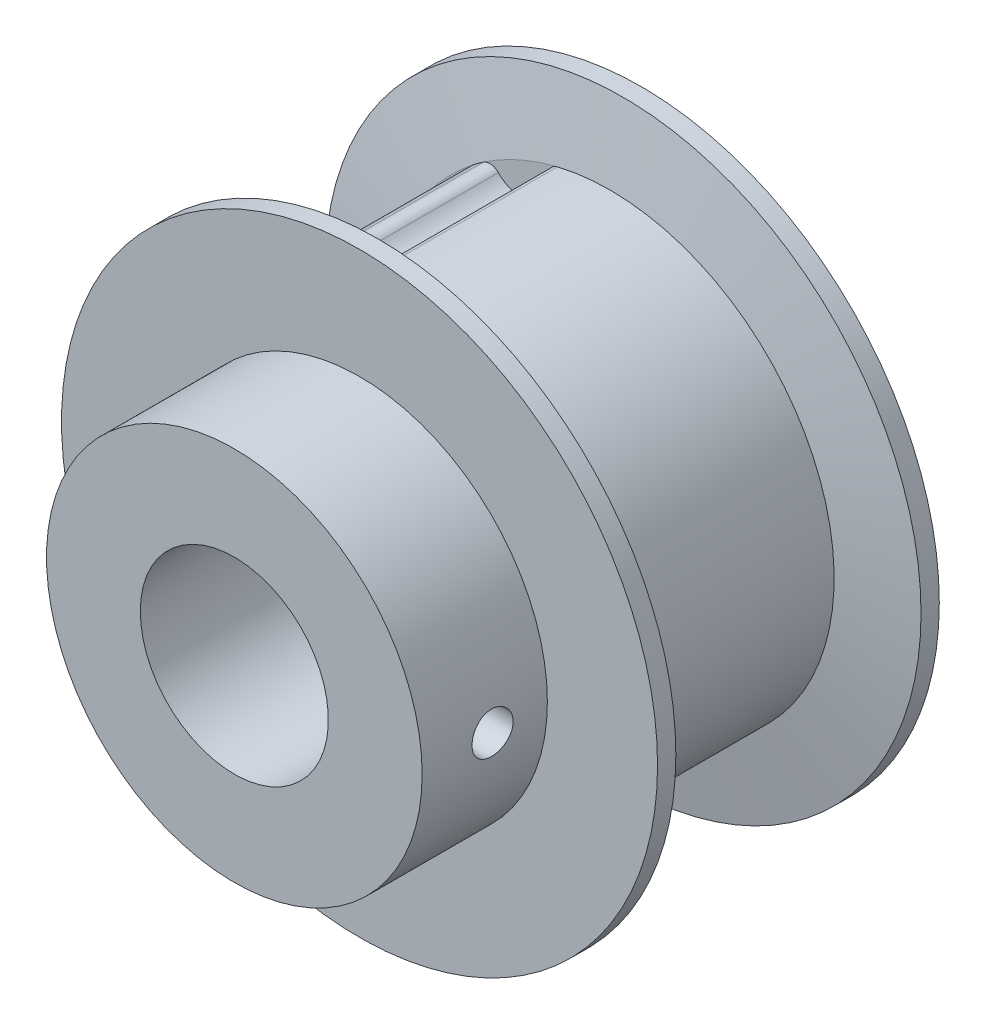
ISO-10303-21;
HEADER;
FILE_DESCRIPTION(('STEP AP214'),'2;1');
FILE_NAME('part.step','',(''),(''),'','','');
FILE_SCHEMA(('AUTOMOTIVE_DESIGN { 1 0 10303 214 1 1 1 1 }'));
ENDSEC;
DATA;
#1=APPLICATION_CONTEXT('core data for automotive mechanical design processes');
#2=APPLICATION_PROTOCOL_DEFINITION('international standard','automotive_design',2000,#1);
#3=PRODUCT_CONTEXT('',#1,'mechanical');
#4=PRODUCT('Part','Part','',(#3));
#5=PRODUCT_RELATED_PRODUCT_CATEGORY('part','',(#4));
#6=PRODUCT_DEFINITION_FORMATION('','',#4);
#7=PRODUCT_DEFINITION_CONTEXT('part definition',#1,'design');
#8=PRODUCT_DEFINITION('design','',#6,#7);
#9=PRODUCT_DEFINITION_SHAPE('','',#8);
#10=(LENGTH_UNIT() NAMED_UNIT(*) SI_UNIT(.MILLI.,.METRE.));
#11=(NAMED_UNIT(*) PLANE_ANGLE_UNIT() SI_UNIT($,.RADIAN.));
#12=(NAMED_UNIT(*) SI_UNIT($,.STERADIAN.) SOLID_ANGLE_UNIT());
#13=UNCERTAINTY_MEASURE_WITH_UNIT(LENGTH_MEASURE(1.E-05),#10,'distance_accuracy_value','');
#14=(GEOMETRIC_REPRESENTATION_CONTEXT(3) GLOBAL_UNCERTAINTY_ASSIGNED_CONTEXT((#13)) GLOBAL_UNIT_ASSIGNED_CONTEXT((#10,
#11,#12)) REPRESENTATION_CONTEXT('',''));
#15=CARTESIAN_POINT('',(0.,0.,0.));
#16=DIRECTION('',(0.,0.,1.));
#17=DIRECTION('',(1.,0.,0.));
#18=AXIS2_PLACEMENT_3D('',#15,#16,#17);
#19=CARTESIAN_POINT('',(0.,0.,-6.83854493654546));
#20=DIRECTION('',(0.,0.,1.));
#21=DIRECTION('',(1.,0.,0.));
#22=AXIS2_PLACEMENT_3D('',#19,#20,#21);
#23=CYLINDRICAL_SURFACE('',#22,11.3665);
#24=DIRECTION('',(0.,0.,1.));
#25=VECTOR('',#24,1.);
#26=CARTESIAN_POINT('',(-6.92571975920571,9.01286458718603,5.55625));
#27=LINE('',#26,#25);
#28=CARTESIAN_POINT('',(-6.92571975985629,9.0128645866861,5.55624999999923));
#29=VERTEX_POINT('',#28);
#30=CARTESIAN_POINT('',(-6.92571975985654,9.01286458668643,-5.55624999999925));
#31=VERTEX_POINT('',#30);
#32=EDGE_CURVE('E222',#29,#31,#27,.F.);
#33=ORIENTED_EDGE('',*,*,#32,.F.);
#34=CARTESIAN_POINT('',(0.,0.,5.55625));
#35=DIRECTION('',(0.,0.,1.));
#36=DIRECTION('',(1.,0.,0.));
#37=AXIS2_PLACEMENT_3D('',#34,#35,#36);
#38=CIRCLE('',#37,11.3665);
#39=CARTESIAN_POINT('',(-6.43157849157934,9.37187923293224,5.55625000000005));
#40=VERTEX_POINT('',#39);
#41=EDGE_CURVE('E240',#29,#40,#38,.F.);
#42=ORIENTED_EDGE('',*,*,#41,.T.);
#43=DIRECTION('',(0.,0.,1.));
#44=VECTOR('',#43,1.);
#45=CARTESIAN_POINT('',(-6.43157849225601,9.37187923246853,5.55625));
#46=LINE('',#45,#44);
#47=CARTESIAN_POINT('',(-6.43157849157945,9.3718792329324,-5.5562499999992));
#48=VERTEX_POINT('',#47);
#49=EDGE_CURVE('E219',#48,#40,#46,.T.);
#50=ORIENTED_EDGE('',*,*,#49,.F.);
#51=CARTESIAN_POINT('',(0.,0.,-5.55625));
#52=DIRECTION('',(0.,0.,1.));
#53=DIRECTION('',(1.,0.,0.));
#54=AXIS2_PLACEMENT_3D('',#51,#52,#53);
#55=CIRCLE('',#54,11.3665);
#56=EDGE_CURVE('E243',#48,#31,#55,.T.);
#57=ORIENTED_EDGE('',*,*,#56,.T.);
#58=EDGE_LOOP('',(#33,#42,#50,#57));
#59=FACE_BOUND('',#58,.T.);
#60=ADVANCED_FACE('F16',(#59),#23,.T.);
#61=CARTESIAN_POINT('',(0.,0.,-6.83854493654546));
#62=DIRECTION('',(0.,0.,1.));
#63=DIRECTION('',(1.,0.,0.));
#64=AXIS2_PLACEMENT_3D('',#61,#62,#63);
#65=CYLINDRICAL_SURFACE('',#64,11.3665);
#66=CARTESIAN_POINT('',(0.,0.,-5.55625));
#67=DIRECTION('',(0.,0.,1.));
#68=DIRECTION('',(1.,0.,0.));
#69=AXIS2_PLACEMENT_3D('',#66,#67,#68);
#70=CIRCLE('',#69,11.3665);
#71=CARTESIAN_POINT('',(-9.68742601496993,5.94567905747549,-5.55624999999925));
#72=VERTEX_POINT('',#71);
#73=CARTESIAN_POINT('',(-9.99282211400751,5.41671749750633,-5.55624999999916));
#74=VERTEX_POINT('',#73);
#75=EDGE_CURVE('E235',#72,#74,#70,.T.);
#76=ORIENTED_EDGE('',*,*,#75,.T.);
#77=DIRECTION('',(0.,0.,1.));
#78=VECTOR('',#77,1.);
#79=CARTESIAN_POINT('',(-9.99282211361638,5.41671749822686,5.55625));
#80=LINE('',#79,#78);
#81=CARTESIAN_POINT('',(-9.99282211400708,5.4167174975061,5.5562499999992));
#82=VERTEX_POINT('',#81);
#83=EDGE_CURVE('E211',#82,#74,#80,.F.);
#84=ORIENTED_EDGE('',*,*,#83,.F.);
#85=CARTESIAN_POINT('',(0.,0.,5.55625));
#86=DIRECTION('',(0.,0.,1.));
#87=DIRECTION('',(1.,0.,0.));
#88=AXIS2_PLACEMENT_3D('',#85,#86,#87);
#89=CIRCLE('',#88,11.3665);
#90=CARTESIAN_POINT('',(-9.68742601496977,5.94567905747539,5.55624999999923));
#91=VERTEX_POINT('',#90);
#92=EDGE_CURVE('E242',#82,#91,#89,.F.);
#93=ORIENTED_EDGE('',*,*,#92,.T.);
#94=DIRECTION('',(0.,0.,1.));
#95=VECTOR('',#94,1.);
#96=CARTESIAN_POINT('',(-9.68742601539869,5.94567905677654,5.55625));
#97=LINE('',#96,#95);
#98=EDGE_CURVE('E228',#72,#91,#97,.T.);
#99=ORIENTED_EDGE('',*,*,#98,.F.);
#100=EDGE_LOOP('',(#76,#84,#93,#99));
#101=FACE_BOUND('',#100,.T.);
#102=ADVANCED_FACE('F341',(#101),#65,.T.);
#103=CARTESIAN_POINT('',(-9.17653606159526,5.63211922404484,5.55625));
#104=DIRECTION('',(0.,0.,1.));
#105=DIRECTION('',(1.,0.,0.));
#106=AXIS2_PLACEMENT_3D('',#103,#104,#105);
#107=CYLINDRICAL_SURFACE('',#106,0.59944);
#108=CARTESIAN_POINT('',(-9.17653606159526,5.63211922404484,-5.55625));
#109=DIRECTION('',(0.,0.,1.));
#110=DIRECTION('',(1.,0.,0.));
#111=AXIS2_PLACEMENT_3D('',#108,#109,#110);
#112=CIRCLE('',#111,0.59944);
#113=CARTESIAN_POINT('',(-8.9552052355263,6.18920178438181,-5.55625));
#114=VERTEX_POINT('',#113);
#115=EDGE_CURVE('E19',#114,#72,#112,.T.);
#116=ORIENTED_EDGE('',*,*,#115,.T.);
#117=ORIENTED_EDGE('',*,*,#98,.T.);
#118=CARTESIAN_POINT('',(-9.17653606159526,5.63211922404484,5.55625));
#119=DIRECTION('',(0.,0.,1.));
#120=DIRECTION('',(1.,0.,0.));
#121=AXIS2_PLACEMENT_3D('',#118,#119,#120);
#122=CIRCLE('',#121,0.59944);
#123=CARTESIAN_POINT('',(-8.9552052355263,6.18920178438181,5.55625));
#124=VERTEX_POINT('',#123);
#125=EDGE_CURVE('E215',#91,#124,#122,.F.);
#126=ORIENTED_EDGE('',*,*,#125,.T.);
#127=DIRECTION('',(0.,0.,1.));
#128=VECTOR('',#127,1.);
#129=CARTESIAN_POINT('',(-8.95520523552598,6.18920178438165,5.55625));
#130=LINE('',#129,#128);
#131=EDGE_CURVE('E202',#124,#114,#130,.F.);
#132=ORIENTED_EDGE('',*,*,#131,.T.);
#133=EDGE_LOOP('',(#116,#117,#126,#132));
#134=FACE_BOUND('',#133,.T.);
#135=ADVANCED_FACE('F332',(#134),#107,.T.);
#136=CARTESIAN_POINT('',(-6.5604750982768,8.53754926946218,5.55625));
#137=DIRECTION('',(0.,0.,1.));
#138=DIRECTION('',(1.,0.,0.));
#139=AXIS2_PLACEMENT_3D('',#136,#137,#138);
#140=CYLINDRICAL_SURFACE('',#139,0.59944);
#141=DIRECTION('',(0.,0.,1.));
#142=VECTOR('',#141,1.);
#143=CARTESIAN_POINT('',(-7.09137053093834,8.25919993287166,5.55625));
#144=LINE('',#143,#142);
#145=CARTESIAN_POINT('',(-7.09137053093783,8.25919993287182,-5.55625));
#146=VERTEX_POINT('',#145);
#147=CARTESIAN_POINT('',(-7.09137053093783,8.25919993287182,5.55625));
#148=VERTEX_POINT('',#147);
#149=EDGE_CURVE('E197',#146,#148,#144,.T.);
#150=ORIENTED_EDGE('',*,*,#149,.T.);
#151=CARTESIAN_POINT('',(-6.5604750982768,8.53754926946218,5.55625));
#152=DIRECTION('',(0.,0.,1.));
#153=DIRECTION('',(1.,0.,0.));
#154=AXIS2_PLACEMENT_3D('',#151,#152,#153);
#155=CIRCLE('',#154,0.59944);
#156=EDGE_CURVE('E212',#148,#29,#155,.F.);
#157=ORIENTED_EDGE('',*,*,#156,.T.);
#158=ORIENTED_EDGE('',*,*,#32,.T.);
#159=CARTESIAN_POINT('',(-6.5604750982768,8.53754926946218,-5.55625));
#160=DIRECTION('',(0.,0.,1.));
#161=DIRECTION('',(1.,0.,0.));
#162=AXIS2_PLACEMENT_3D('',#159,#160,#161);
#163=CIRCLE('',#162,0.59944);
#164=EDGE_CURVE('E221',#31,#146,#163,.T.);
#165=ORIENTED_EDGE('',*,*,#164,.T.);
#166=EDGE_LOOP('',(#150,#157,#158,#165));
#167=FACE_BOUND('',#166,.T.);
#168=ADVANCED_FACE('F347',(#167),#140,.T.);
#169=CARTESIAN_POINT('',(-6.09239356937188,8.87763040678648,5.55625));
#170=DIRECTION('',(0.,0.,1.));
#171=DIRECTION('',(1.,0.,0.));
#172=AXIS2_PLACEMENT_3D('',#169,#170,#171);
#173=CYLINDRICAL_SURFACE('',#172,0.59944);
#174=CARTESIAN_POINT('',(-6.09239356937188,8.87763040678648,-5.55625));
#175=DIRECTION('',(0.,0.,1.));
#176=DIRECTION('',(1.,0.,0.));
#177=AXIS2_PLACEMENT_3D('',#174,#175,#176);
#178=CIRCLE('',#177,0.59944);
#179=CARTESIAN_POINT('',(-5.66361190807295,9.29652729210982,-5.55625));
#180=VERTEX_POINT('',#179);
#181=EDGE_CURVE('E220',#180,#48,#178,.T.);
#182=ORIENTED_EDGE('',*,*,#181,.T.);
#183=ORIENTED_EDGE('',*,*,#49,.T.);
#184=CARTESIAN_POINT('',(-6.09239356937188,8.87763040678648,5.55625));
#185=DIRECTION('',(0.,0.,1.));
#186=DIRECTION('',(1.,0.,0.));
#187=AXIS2_PLACEMENT_3D('',#184,#185,#186);
#188=CIRCLE('',#187,0.59944);
#189=CARTESIAN_POINT('',(-5.66361190807295,9.29652729210982,5.55625));
#190=VERTEX_POINT('',#189);
#191=EDGE_CURVE('E217',#40,#190,#188,.F.);
#192=ORIENTED_EDGE('',*,*,#191,.T.);
#193=DIRECTION('',(0.,0.,1.));
#194=VECTOR('',#193,1.);
#195=CARTESIAN_POINT('',(-5.66361190807289,9.29652729210959,5.55625));
#196=LINE('',#195,#194);
#197=EDGE_CURVE('E193',#190,#180,#196,.F.);
#198=ORIENTED_EDGE('',*,*,#197,.T.);
#199=EDGE_LOOP('',(#182,#183,#192,#198));
#200=FACE_BOUND('',#199,.T.);
#201=ADVANCED_FACE('F353',(#200),#173,.T.);
#202=CARTESIAN_POINT('',(0.,0.,5.55625));
#203=DIRECTION('',(0.,0.,1.));
#204=DIRECTION('',(1.,0.,0.));
#205=AXIS2_PLACEMENT_3D('',#202,#203,#204);
#206=PLANE('',#205);
#207=CARTESIAN_POINT('',(-4.81474897364002,10.3207619131949,5.55625));
#208=DIRECTION('',(0.,0.,1.));
#209=DIRECTION('',(1.,0.,0.));
#210=AXIS2_PLACEMENT_3D('',#207,#208,#209);
#211=CIRCLE('',#210,1.69926);
#212=CARTESIAN_POINT('',(-3.11897008181064,10.4294748269975,5.55625));
#213=VERTEX_POINT('',#212);
#214=CARTESIAN_POINT('',(-3.94512141991133,8.86088778663605,5.55625));
#215=VERTEX_POINT('',#214);
#216=EDGE_CURVE('E189',#213,#215,#211,.F.);
#217=ORIENTED_EDGE('',*,*,#216,.T.);
#218=CARTESIAN_POINT('',(-4.4481249105777,10.4839934627941,5.55625));
#219=DIRECTION('',(0.,0.,1.));
#220=DIRECTION('',(1.,0.,0.));
#221=AXIS2_PLACEMENT_3D('',#218,#219,#220);
#222=CIRCLE('',#221,1.69926);
#223=EDGE_CURVE('E194',#215,#190,#222,.F.);
#224=ORIENTED_EDGE('',*,*,#223,.T.);
#225=ORIENTED_EDGE('',*,*,#191,.F.);
#226=CARTESIAN_POINT('',(0.,0.,5.55624999999832));
#227=DIRECTION('',(0.,0.,1.));
#228=DIRECTION('',(1.,0.,0.));
#229=AXIS2_PLACEMENT_3D('',#226,#227,#228);
#230=CIRCLE('',#229,11.3665000000005);
#231=CARTESIAN_POINT('',(-2.66109754103617,11.0506055095227,5.55624999999921));
#232=VERTEX_POINT('',#231);
#233=EDGE_CURVE('E181',#232,#40,#230,.T.);
#234=ORIENTED_EDGE('',*,*,#233,.F.);
#235=CARTESIAN_POINT('',(-2.52075809605285,10.4678249729721,5.55625));
#236=DIRECTION('',(0.,0.,1.));
#237=DIRECTION('',(1.,0.,0.));
#238=AXIS2_PLACEMENT_3D('',#235,#236,#237);
#239=CIRCLE('',#238,0.59944);
#240=EDGE_CURVE('E185',#213,#232,#239,.F.);
#241=ORIENTED_EDGE('',*,*,#240,.F.);
#242=EDGE_LOOP('',(#217,#224,#225,#234,#241));
#243=FACE_BOUND('',#242,.T.);
#244=ADVANCED_FACE('F356',(#243),#206,.F.);
#245=CARTESIAN_POINT('',(0.,0.,5.55625));
#246=DIRECTION('',(0.,0.,1.));
#247=DIRECTION('',(1.,0.,0.));
#248=AXIS2_PLACEMENT_3D('',#245,#246,#247);
#249=PLANE('',#248);
#250=CARTESIAN_POINT('',(-8.59632410911572,7.47015033041876,5.55625));
#251=DIRECTION('',(0.,0.,1.));
#252=DIRECTION('',(1.,0.,0.));
#253=AXIS2_PLACEMENT_3D('',#250,#251,#252);
#254=CIRCLE('',#253,1.69926);
#255=CARTESIAN_POINT('',(-7.20809550601794,6.49019834529848,5.55625));
#256=VERTEX_POINT('',#255);
#257=EDGE_CURVE('E198',#148,#256,#254,.F.);
#258=ORIENTED_EDGE('',*,*,#257,.T.);
#259=CARTESIAN_POINT('',(-8.32778861417102,7.76838921177826,5.55625));
#260=DIRECTION('',(0.,0.,1.));
#261=DIRECTION('',(1.,0.,0.));
#262=AXIS2_PLACEMENT_3D('',#259,#260,#261);
#263=CIRCLE('',#262,1.69926);
#264=EDGE_CURVE('E203',#256,#124,#263,.F.);
#265=ORIENTED_EDGE('',*,*,#264,.T.);
#266=ORIENTED_EDGE('',*,*,#125,.F.);
#267=CARTESIAN_POINT('',(0.,0.,5.55624999999837));
#268=DIRECTION('',(0.,0.,1.));
#269=DIRECTION('',(1.,0.,0.));
#270=AXIS2_PLACEMENT_3D('',#267,#268,#269);
#271=CIRCLE('',#270,11.3665000000008);
#272=EDGE_CURVE('E178',#29,#91,#271,.T.);
#273=ORIENTED_EDGE('',*,*,#272,.F.);
#274=ORIENTED_EDGE('',*,*,#156,.F.);
#275=EDGE_LOOP('',(#258,#265,#266,#273,#274));
#276=FACE_BOUND('',#275,.T.);
#277=ADVANCED_FACE('F360',(#276),#249,.F.);
#278=CARTESIAN_POINT('',(0.,0.,5.55625));
#279=DIRECTION('',(0.,0.,1.));
#280=DIRECTION('',(1.,0.,0.));
#281=AXIS2_PLACEMENT_3D('',#278,#279,#280);
#282=PLANE('',#281);
#283=CARTESIAN_POINT('',(-10.8915167109718,3.32788189132984,5.55625));
#284=DIRECTION('',(0.,0.,1.));
#285=DIRECTION('',(1.,0.,0.));
#286=AXIS2_PLACEMENT_3D('',#283,#284,#285);
#287=CIRCLE('',#286,1.69926);
#288=CARTESIAN_POINT('',(-9.83760859218593,4.66083433787746,5.55625));
#289=VERTEX_POINT('',#288);
#290=CARTESIAN_POINT('',(-9.22472439563864,2.99729464846287,5.55625));
#291=VERTEX_POINT('',#290);
#292=EDGE_CURVE('E141',#289,#291,#287,.F.);
#293=ORIENTED_EDGE('',*,*,#292,.T.);
#294=CARTESIAN_POINT('',(-10.7675020107898,3.7095598924478,5.55625));
#295=DIRECTION('',(0.,0.,1.));
#296=DIRECTION('',(1.,0.,0.));
#297=AXIS2_PLACEMENT_3D('',#294,#295,#296);
#298=CIRCLE('',#297,1.69926);
#299=CARTESIAN_POINT('',(-10.6983622222705,2.01170706100379,5.55625));
#300=VERTEX_POINT('',#299);
#301=EDGE_CURVE('E119',#291,#300,#298,.F.);
#302=ORIENTED_EDGE('',*,*,#301,.T.);
#303=CARTESIAN_POINT('',(-10.6739721025541,1.41276346127185,5.55625));
#304=DIRECTION('',(0.,0.,1.));
#305=DIRECTION('',(1.,0.,0.));
#306=AXIS2_PLACEMENT_3D('',#303,#304,#305);
#307=CIRCLE('',#306,0.59944);
#308=CARTESIAN_POINT('',(-11.2682295728675,1.49141695818421,5.5562499999992));
#309=VERTEX_POINT('',#308);
#310=EDGE_CURVE('E136',#309,#300,#307,.F.);
#311=ORIENTED_EDGE('',*,*,#310,.F.);
#312=CARTESIAN_POINT('',(0.,0.,5.5562499999983));
#313=DIRECTION('',(0.,0.,1.));
#314=DIRECTION('',(1.,0.,0.));
#315=AXIS2_PLACEMENT_3D('',#312,#313,#314);
#316=CIRCLE('',#315,11.3665000000004);
#317=EDGE_CURVE('E176',#82,#309,#316,.T.);
#318=ORIENTED_EDGE('',*,*,#317,.F.);
#319=CARTESIAN_POINT('',(-9.46582635596246,5.13105373606098,5.55625));
#320=DIRECTION('',(0.,0.,1.));
#321=DIRECTION('',(1.,0.,0.));
#322=AXIS2_PLACEMENT_3D('',#319,#320,#321);
#323=CIRCLE('',#322,0.59944);
#324=EDGE_CURVE('E206',#289,#82,#323,.F.);
#325=ORIENTED_EDGE('',*,*,#324,.F.);
#326=EDGE_LOOP('',(#293,#302,#311,#318,#325));
#327=FACE_BOUND('',#326,.T.);
#328=ADVANCED_FACE('F364',(#327),#282,.F.);
#329=CARTESIAN_POINT('',(-9.46582635596246,5.13105373606098,5.55625));
#330=DIRECTION('',(0.,0.,1.));
#331=DIRECTION('',(1.,0.,0.));
#332=AXIS2_PLACEMENT_3D('',#329,#330,#331);
#333=CYLINDRICAL_SURFACE('',#332,0.59944);
#334=DIRECTION('',(0.,0.,1.));
#335=VECTOR('',#334,1.);
#336=CARTESIAN_POINT('',(-9.83760859218621,4.66083433787767,5.55625));
#337=LINE('',#336,#335);
#338=CARTESIAN_POINT('',(-9.83760859218609,4.66083433787726,-5.55625));
#339=VERTEX_POINT('',#338);
#340=EDGE_CURVE('E171',#339,#289,#337,.T.);
#341=ORIENTED_EDGE('',*,*,#340,.T.);
#342=ORIENTED_EDGE('',*,*,#324,.T.);
#343=ORIENTED_EDGE('',*,*,#83,.T.);
#344=CARTESIAN_POINT('',(-9.46582635596246,5.13105373606098,-5.55625));
#345=DIRECTION('',(0.,0.,1.));
#346=DIRECTION('',(1.,0.,0.));
#347=AXIS2_PLACEMENT_3D('',#344,#345,#346);
#348=CIRCLE('',#347,0.59944);
#349=EDGE_CURVE('E209',#74,#339,#348,.T.);
#350=ORIENTED_EDGE('',*,*,#349,.T.);
#351=EDGE_LOOP('',(#341,#342,#343,#350));
#352=FACE_BOUND('',#351,.T.);
#353=ADVANCED_FACE('F368',(#352),#333,.T.);
#354=CARTESIAN_POINT('',(0.,0.,-7.14375));
#355=DIRECTION('',(0.,0.,1.));
#356=DIRECTION('',(1.,0.,0.));
#357=AXIS2_PLACEMENT_3D('',#354,#355,#356);
#358=CYLINDRICAL_SURFACE('',#357,15.113);
#359=CARTESIAN_POINT('',(0.,0.,7.14375));
#360=DIRECTION('',(0.,0.,1.));
#361=DIRECTION('',(1.,0.,0.));
#362=AXIS2_PLACEMENT_3D('',#359,#360,#361);
#363=CIRCLE('',#362,15.113);
#364=CARTESIAN_POINT('',(15.113,0.,7.14375));
#365=VERTEX_POINT('',#364);
#366=EDGE_CURVE('E168',#365,#365,#363,.T.);
#367=ORIENTED_EDGE('',*,*,#366,.F.);
#368=EDGE_LOOP('',(#367));
#369=FACE_BOUND('',#368,.T.);
#370=CARTESIAN_POINT('',(0.,0.,6.21685903322354));
#371=DIRECTION('',(0.,0.,1.));
#372=DIRECTION('',(0.,1.,0.));
#373=AXIS2_PLACEMENT_3D('',#370,#371,#372);
#374=CIRCLE('',#373,15.1130000000001);
#375=CARTESIAN_POINT('',(0.,15.1130000000001,6.21685903322354));
#376=VERTEX_POINT('',#375);
#377=EDGE_CURVE('E184',#376,#376,#374,.F.);
#378=ORIENTED_EDGE('',*,*,#377,.F.);
#379=EDGE_LOOP('',(#378));
#380=FACE_BOUND('',#379,.T.);
#381=ADVANCED_FACE('F372',(#369,#380),#358,.T.);
#382=CARTESIAN_POINT('',(-8.32778861417102,7.76838921177826,5.55625));
#383=DIRECTION('',(0.,0.,1.));
#384=DIRECTION('',(1.,0.,0.));
#385=AXIS2_PLACEMENT_3D('',#382,#383,#384);
#386=CYLINDRICAL_SURFACE('',#385,1.69926);
#387=CARTESIAN_POINT('',(-8.32778861417102,7.76838921177826,-5.55625));
#388=DIRECTION('',(0.,0.,1.));
#389=DIRECTION('',(1.,0.,0.));
#390=AXIS2_PLACEMENT_3D('',#387,#388,#389);
#391=CIRCLE('',#390,1.69926);
#392=CARTESIAN_POINT('',(-7.20809550601794,6.49019834529848,-5.55625));
#393=VERTEX_POINT('',#392);
#394=EDGE_CURVE('E166',#114,#393,#391,.T.);
#395=ORIENTED_EDGE('',*,*,#394,.F.);
#396=ORIENTED_EDGE('',*,*,#131,.F.);
#397=ORIENTED_EDGE('',*,*,#264,.F.);
#398=DIRECTION('',(0.,0.,1.));
#399=VECTOR('',#398,1.);
#400=CARTESIAN_POINT('',(-7.20809550601637,6.49019834530069,5.55625));
#401=LINE('',#400,#399);
#402=EDGE_CURVE('E201',#256,#393,#401,.F.);
#403=ORIENTED_EDGE('',*,*,#402,.T.);
#404=EDGE_LOOP('',(#395,#396,#397,#403));
#405=FACE_BOUND('',#404,.T.);
#406=ADVANCED_FACE('F376',(#405),#386,.F.);
#407=CARTESIAN_POINT('',(-8.59632410911572,7.47015033041876,5.55625));
#408=DIRECTION('',(0.,0.,1.));
#409=DIRECTION('',(1.,0.,0.));
#410=AXIS2_PLACEMENT_3D('',#407,#408,#409);
#411=CYLINDRICAL_SURFACE('',#410,1.69926);
#412=CARTESIAN_POINT('',(-8.59632410911572,7.47015033041876,-5.55625));
#413=DIRECTION('',(0.,0.,1.));
#414=DIRECTION('',(1.,0.,0.));
#415=AXIS2_PLACEMENT_3D('',#412,#413,#414);
#416=CIRCLE('',#415,1.69926);
#417=EDGE_CURVE('E163',#393,#146,#416,.T.);
#418=ORIENTED_EDGE('',*,*,#417,.F.);
#419=ORIENTED_EDGE('',*,*,#402,.F.);
#420=ORIENTED_EDGE('',*,*,#257,.F.);
#421=ORIENTED_EDGE('',*,*,#149,.F.);
#422=EDGE_LOOP('',(#418,#419,#420,#421));
#423=FACE_BOUND('',#422,.T.);
#424=ADVANCED_FACE('F380',(#423),#411,.F.);
#425=CARTESIAN_POINT('',(-4.4481249105777,10.4839934627941,5.55625));
#426=DIRECTION('',(0.,0.,1.));
#427=DIRECTION('',(1.,0.,0.));
#428=AXIS2_PLACEMENT_3D('',#425,#426,#427);
#429=CYLINDRICAL_SURFACE('',#428,1.69926);
#430=CARTESIAN_POINT('',(-4.4481249105777,10.4839934627941,-5.55625));
#431=DIRECTION('',(0.,0.,1.));
#432=DIRECTION('',(1.,0.,0.));
#433=AXIS2_PLACEMENT_3D('',#430,#431,#432);
#434=CIRCLE('',#433,1.69926);
#435=CARTESIAN_POINT('',(-3.94512141991133,8.86088778663605,-5.55625));
#436=VERTEX_POINT('',#435);
#437=EDGE_CURVE('E161',#180,#436,#434,.T.);
#438=ORIENTED_EDGE('',*,*,#437,.F.);
#439=ORIENTED_EDGE('',*,*,#197,.F.);
#440=ORIENTED_EDGE('',*,*,#223,.F.);
#441=DIRECTION('',(0.,0.,1.));
#442=VECTOR('',#441,1.);
#443=CARTESIAN_POINT('',(-3.94512141991031,8.86088778663666,5.55625));
#444=LINE('',#443,#442);
#445=EDGE_CURVE('E192',#215,#436,#444,.F.);
#446=ORIENTED_EDGE('',*,*,#445,.T.);
#447=EDGE_LOOP('',(#438,#439,#440,#446));
#448=FACE_BOUND('',#447,.T.);
#449=ADVANCED_FACE('F384',(#448),#429,.F.);
#450=CARTESIAN_POINT('',(-4.81474897364002,10.3207619131949,5.55625));
#451=DIRECTION('',(0.,0.,1.));
#452=DIRECTION('',(1.,0.,0.));
#453=AXIS2_PLACEMENT_3D('',#450,#451,#452);
#454=CYLINDRICAL_SURFACE('',#453,1.69926);
#455=CARTESIAN_POINT('',(-4.81474897364002,10.3207619131949,-5.55625));
#456=DIRECTION('',(0.,0.,1.));
#457=DIRECTION('',(1.,0.,0.));
#458=AXIS2_PLACEMENT_3D('',#455,#456,#457);
#459=CIRCLE('',#458,1.69926);
#460=CARTESIAN_POINT('',(-3.11897008181064,10.4294748269975,-5.55625));
#461=VERTEX_POINT('',#460);
#462=EDGE_CURVE('E159',#436,#461,#459,.T.);
#463=ORIENTED_EDGE('',*,*,#462,.F.);
#464=ORIENTED_EDGE('',*,*,#445,.F.);
#465=ORIENTED_EDGE('',*,*,#216,.F.);
#466=DIRECTION('',(0.,0.,1.));
#467=VECTOR('',#466,1.);
#468=CARTESIAN_POINT('',(-3.11897008181021,10.429474826998,5.55625));
#469=LINE('',#468,#467);
#470=EDGE_CURVE('E188',#461,#213,#469,.T.);
#471=ORIENTED_EDGE('',*,*,#470,.F.);
#472=EDGE_LOOP('',(#463,#464,#465,#471));
#473=FACE_BOUND('',#472,.T.);
#474=ADVANCED_FACE('F388',(#473),#454,.F.);
#475=CARTESIAN_POINT('',(-2.52075809605285,10.4678249729721,5.55625));
#476=DIRECTION('',(0.,0.,1.));
#477=DIRECTION('',(1.,0.,0.));
#478=AXIS2_PLACEMENT_3D('',#475,#476,#477);
#479=CYLINDRICAL_SURFACE('',#478,0.59944);
#480=ORIENTED_EDGE('',*,*,#240,.T.);
#481=DIRECTION('',(0.,0.,1.));
#482=VECTOR('',#481,1.);
#483=CARTESIAN_POINT('',(-2.66109754023772,11.0506055097149,-6.83854493654546));
#484=LINE('',#483,#482);
#485=CARTESIAN_POINT('',(-2.66109754103616,11.0506055095227,-5.5562499999992));
#486=VERTEX_POINT('',#485);
#487=EDGE_CURVE('E158',#486,#232,#484,.T.);
#488=ORIENTED_EDGE('',*,*,#487,.F.);
#489=CARTESIAN_POINT('',(-2.52075809605285,10.4678249729721,-5.55625));
#490=DIRECTION('',(0.,0.,1.));
#491=DIRECTION('',(1.,0.,0.));
#492=AXIS2_PLACEMENT_3D('',#489,#490,#491);
#493=CIRCLE('',#492,0.59944);
#494=EDGE_CURVE('E155',#461,#486,#493,.F.);
#495=ORIENTED_EDGE('',*,*,#494,.F.);
#496=ORIENTED_EDGE('',*,*,#470,.T.);
#497=EDGE_LOOP('',(#480,#488,#495,#496));
#498=FACE_BOUND('',#497,.T.);
#499=ADVANCED_FACE('F392',(#498),#479,.T.);
#500=CARTESIAN_POINT('',(0.,0.,6.21685903322354));
#501=DIRECTION('',(0.,0.,1.));
#502=DIRECTION('',(1.,0.,0.));
#503=AXIS2_PLACEMENT_3D('',#500,#501,#502);
#504=CONICAL_SURFACE('',#503,15.1130000000001,1.3962634015952);
#505=ORIENTED_EDGE('',*,*,#377,.T.);
#506=EDGE_LOOP('',(#505));
#507=FACE_BOUND('',#506,.T.);
#508=ORIENTED_EDGE('',*,*,#92,.F.);
#509=ORIENTED_EDGE('',*,*,#317,.T.);
#510=CARTESIAN_POINT('',(0.,0.,5.55625));
#511=DIRECTION('',(0.,0.,1.));
#512=DIRECTION('',(1.,0.,0.));
#513=AXIS2_PLACEMENT_3D('',#510,#511,#512);
#514=CIRCLE('',#513,11.3665);
#515=EDGE_CURVE('E151',#232,#309,#514,.F.);
#516=ORIENTED_EDGE('',*,*,#515,.F.);
#517=ORIENTED_EDGE('',*,*,#233,.T.);
#518=ORIENTED_EDGE('',*,*,#41,.F.);
#519=ORIENTED_EDGE('',*,*,#272,.T.);
#520=EDGE_LOOP('',(#508,#509,#516,#517,#518,#519));
#521=FACE_BOUND('',#520,.T.);
#522=ADVANCED_FACE('F396',(#507,#521),#504,.T.);
#523=CARTESIAN_POINT('',(-10.6739721025541,1.41276346127185,5.55625));
#524=DIRECTION('',(0.,0.,1.));
#525=DIRECTION('',(1.,0.,0.));
#526=AXIS2_PLACEMENT_3D('',#523,#524,#525);
#527=CYLINDRICAL_SURFACE('',#526,0.59944);
#528=CARTESIAN_POINT('',(-10.6739721025541,1.41276346127185,-5.55625));
#529=DIRECTION('',(0.,0.,1.));
#530=DIRECTION('',(1.,0.,0.));
#531=AXIS2_PLACEMENT_3D('',#528,#529,#530);
#532=CIRCLE('',#531,0.59944);
#533=CARTESIAN_POINT('',(-10.6983622222705,2.01170706100379,-5.55625));
#534=VERTEX_POINT('',#533);
#535=CARTESIAN_POINT('',(-11.2682295728676,1.49141695818423,-5.55624999999919));
#536=VERTEX_POINT('',#535);
#537=EDGE_CURVE('E34',#534,#536,#532,.T.);
#538=ORIENTED_EDGE('',*,*,#537,.T.);
#539=DIRECTION('',(0.,0.,1.));
#540=VECTOR('',#539,1.);
#541=CARTESIAN_POINT('',(-11.2682295729749,1.49141695737067,-6.83854493654546));
#542=LINE('',#541,#540);
#543=EDGE_CURVE('E147',#309,#536,#542,.F.);
#544=ORIENTED_EDGE('',*,*,#543,.F.);
#545=ORIENTED_EDGE('',*,*,#310,.T.);
#546=DIRECTION('',(0.,0.,1.));
#547=VECTOR('',#546,1.);
#548=CARTESIAN_POINT('',(-10.6983622222701,2.0117070610035,5.55625));
#549=LINE('',#548,#547);
#550=EDGE_CURVE('E138',#300,#534,#549,.F.);
#551=ORIENTED_EDGE('',*,*,#550,.T.);
#552=EDGE_LOOP('',(#538,#544,#545,#551));
#553=FACE_BOUND('',#552,.T.);
#554=ADVANCED_FACE('F139',(#553),#527,.T.);
#555=CARTESIAN_POINT('',(-10.7675020107898,3.7095598924478,5.55625));
#556=DIRECTION('',(0.,0.,1.));
#557=DIRECTION('',(1.,0.,0.));
#558=AXIS2_PLACEMENT_3D('',#555,#556,#557);
#559=CYLINDRICAL_SURFACE('',#558,1.69926);
#560=CARTESIAN_POINT('',(-10.7675020107898,3.7095598924478,-5.55625));
#561=DIRECTION('',(0.,0.,1.));
#562=DIRECTION('',(1.,0.,0.));
#563=AXIS2_PLACEMENT_3D('',#560,#561,#562);
#564=CIRCLE('',#563,1.69926);
#565=CARTESIAN_POINT('',(-9.22472439563864,2.99729464846287,-5.55625));
#566=VERTEX_POINT('',#565);
#567=EDGE_CURVE('E130',#534,#566,#564,.T.);
#568=ORIENTED_EDGE('',*,*,#567,.F.);
#569=ORIENTED_EDGE('',*,*,#550,.F.);
#570=ORIENTED_EDGE('',*,*,#301,.F.);
#571=DIRECTION('',(0.,0.,1.));
#572=VECTOR('',#571,1.);
#573=CARTESIAN_POINT('',(-9.22472439563877,2.99729464846221,5.55625));
#574=LINE('',#573,#572);
#575=EDGE_CURVE('E144',#291,#566,#574,.F.);
#576=ORIENTED_EDGE('',*,*,#575,.T.);
#577=EDGE_LOOP('',(#568,#569,#570,#576));
#578=FACE_BOUND('',#577,.T.);
#579=ADVANCED_FACE('F143',(#578),#559,.F.);
#580=CARTESIAN_POINT('',(-10.8915167109718,3.32788189132984,5.55625));
#581=DIRECTION('',(0.,0.,1.));
#582=DIRECTION('',(1.,0.,0.));
#583=AXIS2_PLACEMENT_3D('',#580,#581,#582);
#584=CYLINDRICAL_SURFACE('',#583,1.69926);
#585=CARTESIAN_POINT('',(-10.8915167109718,3.32788189132984,-5.55625));
#586=DIRECTION('',(0.,0.,1.));
#587=DIRECTION('',(1.,0.,0.));
#588=AXIS2_PLACEMENT_3D('',#585,#586,#587);
#589=CIRCLE('',#588,1.69926);
#590=EDGE_CURVE('E146',#566,#339,#589,.T.);
#591=ORIENTED_EDGE('',*,*,#590,.F.);
#592=ORIENTED_EDGE('',*,*,#575,.F.);
#593=ORIENTED_EDGE('',*,*,#292,.F.);
#594=ORIENTED_EDGE('',*,*,#340,.F.);
#595=EDGE_LOOP('',(#591,#592,#593,#594));
#596=FACE_BOUND('',#595,.T.);
#597=ADVANCED_FACE('F405',(#596),#584,.F.);
#598=CARTESIAN_POINT('',(0.,0.,7.14375));
#599=DIRECTION('',(0.,0.,1.));
#600=DIRECTION('',(1.,0.,0.));
#601=AXIS2_PLACEMENT_3D('',#598,#599,#600);
#602=PLANE('',#601);
#603=CARTESIAN_POINT('',(0.,0.,7.14375));
#604=DIRECTION('',(0.,0.,1.));
#605=DIRECTION('',(1.,0.,0.));
#606=AXIS2_PLACEMENT_3D('',#603,#604,#605);
#607=CIRCLE('',#606,9.525);
#608=CARTESIAN_POINT('',(9.525,0.,7.14375));
#609=VERTEX_POINT('',#608);
#610=EDGE_CURVE('E149',#609,#609,#607,.T.);
#611=ORIENTED_EDGE('',*,*,#610,.F.);
#612=EDGE_LOOP('',(#611));
#613=FACE_BOUND('',#612,.T.);
#614=ORIENTED_EDGE('',*,*,#366,.T.);
#615=EDGE_LOOP('',(#614));
#616=FACE_BOUND('',#615,.T.);
#617=ADVANCED_FACE('F408',(#613,#616),#602,.T.);
#618=CARTESIAN_POINT('',(0.,0.,-5.55625));
#619=DIRECTION('',(0.,0.,1.));
#620=DIRECTION('',(1.,0.,0.));
#621=AXIS2_PLACEMENT_3D('',#618,#619,#620);
#622=PLANE('',#621);
#623=ORIENTED_EDGE('',*,*,#164,.F.);
#624=CARTESIAN_POINT('',(0.,0.,-5.55624999999842));
#625=DIRECTION('',(0.,0.,-1.));
#626=DIRECTION('',(-1.,0.,0.));
#627=AXIS2_PLACEMENT_3D('',#624,#625,#626);
#628=CIRCLE('',#627,11.366500000001);
#629=EDGE_CURVE('E336',#72,#31,#628,.T.);
#630=ORIENTED_EDGE('',*,*,#629,.F.);
#631=ORIENTED_EDGE('',*,*,#115,.F.);
#632=ORIENTED_EDGE('',*,*,#394,.T.);
#633=ORIENTED_EDGE('',*,*,#417,.T.);
#634=EDGE_LOOP('',(#623,#630,#631,#632,#633));
#635=FACE_BOUND('',#634,.T.);
#636=ADVANCED_FACE('F337',(#635),#622,.T.);
#637=CARTESIAN_POINT('',(0.,0.,-5.55625));
#638=DIRECTION('',(0.,0.,1.));
#639=DIRECTION('',(1.,0.,0.));
#640=AXIS2_PLACEMENT_3D('',#637,#638,#639);
#641=PLANE('',#640);
#642=ORIENTED_EDGE('',*,*,#494,.T.);
#643=CARTESIAN_POINT('',(0.,0.,-5.55624999999831));
#644=DIRECTION('',(0.,0.,-1.));
#645=DIRECTION('',(-1.,0.,0.));
#646=AXIS2_PLACEMENT_3D('',#643,#644,#645);
#647=CIRCLE('',#646,11.3665000000004);
#648=EDGE_CURVE('E302',#48,#486,#647,.T.);
#649=ORIENTED_EDGE('',*,*,#648,.F.);
#650=ORIENTED_EDGE('',*,*,#181,.F.);
#651=ORIENTED_EDGE('',*,*,#437,.T.);
#652=ORIENTED_EDGE('',*,*,#462,.T.);
#653=EDGE_LOOP('',(#642,#649,#650,#651,#652));
#654=FACE_BOUND('',#653,.T.);
#655=ADVANCED_FACE('F415',(#654),#641,.T.);
#656=CARTESIAN_POINT('',(0.,0.,-6.83854493654546));
#657=DIRECTION('',(0.,0.,1.));
#658=DIRECTION('',(1.,0.,0.));
#659=AXIS2_PLACEMENT_3D('',#656,#657,#658);
#660=CYLINDRICAL_SURFACE('',#659,11.3665);
#661=ORIENTED_EDGE('',*,*,#515,.T.);
#662=ORIENTED_EDGE('',*,*,#543,.T.);
#663=CARTESIAN_POINT('',(0.,0.,-5.55624999999829));
#664=DIRECTION('',(0.,0.,-1.));
#665=DIRECTION('',(0.,-1.,0.));
#666=AXIS2_PLACEMENT_3D('',#663,#664,#665);
#667=CIRCLE('',#666,11.3665000000003);
#668=EDGE_CURVE('E299',#486,#536,#667,.T.);
#669=ORIENTED_EDGE('',*,*,#668,.F.);
#670=ORIENTED_EDGE('',*,*,#487,.T.);
#671=EDGE_LOOP('',(#661,#662,#669,#670));
#672=FACE_BOUND('',#671,.T.);
#673=ADVANCED_FACE('F418',(#672),#660,.T.);
#674=CARTESIAN_POINT('',(0.,0.,-5.55625));
#675=DIRECTION('',(0.,0.,1.));
#676=DIRECTION('',(1.,0.,0.));
#677=AXIS2_PLACEMENT_3D('',#674,#675,#676);
#678=PLANE('',#677);
#679=ORIENTED_EDGE('',*,*,#349,.F.);
#680=CARTESIAN_POINT('',(0.,0.,-5.55624999999831));
#681=DIRECTION('',(0.,0.,-1.));
#682=DIRECTION('',(-1.,0.,0.));
#683=AXIS2_PLACEMENT_3D('',#680,#681,#682);
#684=CIRCLE('',#683,11.3665000000004);
#685=EDGE_CURVE('E135',#536,#74,#684,.T.);
#686=ORIENTED_EDGE('',*,*,#685,.F.);
#687=ORIENTED_EDGE('',*,*,#537,.F.);
#688=ORIENTED_EDGE('',*,*,#567,.T.);
#689=ORIENTED_EDGE('',*,*,#590,.T.);
#690=EDGE_LOOP('',(#679,#686,#687,#688,#689));
#691=FACE_BOUND('',#690,.T.);
#692=ADVANCED_FACE('F133',(#691),#678,.T.);
#693=CARTESIAN_POINT('',(0.,0.,7.14375));
#694=DIRECTION('',(0.,0.,1.));
#695=DIRECTION('',(1.,0.,0.));
#696=AXIS2_PLACEMENT_3D('',#693,#694,#695);
#697=CYLINDRICAL_SURFACE('',#696,9.525);
#698=ORIENTED_EDGE('',*,*,#610,.T.);
#699=EDGE_LOOP('',(#698));
#700=FACE_BOUND('',#699,.T.);
#701=CARTESIAN_POINT('',(0.,0.,13.49375));
#702=DIRECTION('',(0.,0.,1.));
#703=DIRECTION('',(1.,0.,0.));
#704=AXIS2_PLACEMENT_3D('',#701,#702,#703);
#705=CIRCLE('',#704,9.525);
#706=CARTESIAN_POINT('',(9.525,0.,13.49375));
#707=VERTEX_POINT('',#706);
#708=EDGE_CURVE('E258',#707,#707,#705,.T.);
#709=ORIENTED_EDGE('',*,*,#708,.F.);
#710=EDGE_LOOP('',(#709));
#711=FACE_BOUND('',#710,.T.);
#712=CARTESIAN_POINT('',(9.525,0.,8.880475));
#713=CARTESIAN_POINT('',(9.52499884639291,-0.0582735292877637,8.88047967166077));
#714=CARTESIAN_POINT('',(9.52445933936864,-0.116595322619604,8.88538425376087));
#715=CARTESIAN_POINT('',(9.52235688032514,-0.231674615958854,8.90488968679589));
#716=CARTESIAN_POINT('',(9.52079178568485,-0.288428581251986,8.91951083814708));
#717=CARTESIAN_POINT('',(9.51681512818299,-0.39861071646248,8.95801617077216));
#718=CARTESIAN_POINT('',(9.51440442439465,-0.452042197152048,8.98189095364897));
#719=CARTESIAN_POINT('',(9.50900607943094,-0.554115245606016,9.03820802703758));
#720=CARTESIAN_POINT('',(9.50601868600653,-0.602758856780226,9.07064664064402));
#721=CARTESIAN_POINT('',(9.49978626741521,-0.694113585429948,9.14332492104782));
#722=CARTESIAN_POINT('',(9.4965402846776,-0.736800873572002,9.18359446203933));
#723=CARTESIAN_POINT('',(9.49016425329055,-0.814827559109186,9.27072938053116));
#724=CARTESIAN_POINT('',(9.48703421590986,-0.850166243823228,9.31759539703144));
#725=CARTESIAN_POINT('',(9.4812353245689,-0.912573290224957,9.41673800135184));
#726=CARTESIAN_POINT('',(9.47856765765727,-0.93962049790762,9.46902798031357));
#727=CARTESIAN_POINT('',(9.47400738878788,-0.984541426813792,9.57744118618277));
#728=CARTESIAN_POINT('',(9.4721147573862,-1.00241549653528,9.63356426737452));
#729=CARTESIAN_POINT('',(9.46932745871274,-1.0284135860093,9.74781236295391));
#730=CARTESIAN_POINT('',(9.46842882035886,-1.03657641291381,9.80592844792398));
#731=CARTESIAN_POINT('',(9.46771900124972,-1.04304030312059,9.92271223706762));
#732=CARTESIAN_POINT('',(9.46790778857706,-1.04134165587035,9.98137992500044));
#733=CARTESIAN_POINT('',(9.46934785721121,-1.02816278176514,10.0973323816661));
#734=CARTESIAN_POINT('',(9.47059451212957,-1.01672514582905,10.1546220567511));
#735=CARTESIAN_POINT('',(9.47400264649458,-0.984459128926173,10.2664643603236));
#736=CARTESIAN_POINT('',(9.47616414869426,-0.96363051439681,10.3210169206989));
#737=CARTESIAN_POINT('',(9.48116381762611,-0.913126360227212,10.4259714143602));
#738=CARTESIAN_POINT('',(9.48400343954042,-0.883431760228054,10.4763641036369));
#739=CARTESIAN_POINT('',(9.49003790511303,-0.816054943773715,10.5714626310099));
#740=CARTESIAN_POINT('',(9.49323273206631,-0.778373102876901,10.61616873633));
#741=CARTESIAN_POINT('',(9.49963783803421,-0.695861448725414,10.6988692760937));
#742=CARTESIAN_POINT('',(9.50284811298077,-0.650996249503975,10.7368284120753));
#743=CARTESIAN_POINT('',(9.50890863475556,-0.555488462772245,10.8046996885877));
#744=CARTESIAN_POINT('',(9.51175871514799,-0.504843224888204,10.8346081162721));
#745=CARTESIAN_POINT('',(9.51677936130814,-0.399169316534392,10.8855259522371));
#746=CARTESIAN_POINT('',(9.51894921472695,-0.344136126026761,10.9065260395757));
#747=CARTESIAN_POINT('',(9.52235521284579,-0.231386038017177,10.9389307614459));
#748=CARTESIAN_POINT('',(9.52359333607432,-0.173675105144426,10.9503557346293));
#749=CARTESIAN_POINT('',(9.52476564503519,-0.0771251617079252,10.9611342649028));
#750=CARTESIAN_POINT('',(9.52500076361025,-0.0385731544175607,10.963278092325));
#751=CARTESIAN_POINT('',(9.52499884639291,0.0582735292877628,10.9632703283392));
#752=CARTESIAN_POINT('',(9.52445933936864,0.116595322619603,10.9583657462391));
#753=CARTESIAN_POINT('',(9.52235688032514,0.231674615958853,10.9388603132041));
#754=CARTESIAN_POINT('',(9.52079178568485,0.288428581251985,10.9242391618529));
#755=CARTESIAN_POINT('',(9.51681512818299,0.398610716462479,10.8857338292278));
#756=CARTESIAN_POINT('',(9.51440442439465,0.452042197152047,10.861859046351));
#757=CARTESIAN_POINT('',(9.50900607943094,0.554115245606016,10.8055419729624));
#758=CARTESIAN_POINT('',(9.50601868600653,0.602758856780225,10.773103359356));
#759=CARTESIAN_POINT('',(9.49978626741521,0.694113585429947,10.7004250789522));
#760=CARTESIAN_POINT('',(9.4965402846776,0.736800873572002,10.6601555379607));
#761=CARTESIAN_POINT('',(9.49016425329055,0.814827559109186,10.5730206194688));
#762=CARTESIAN_POINT('',(9.48703421590987,0.850166243823228,10.5261546029686));
#763=CARTESIAN_POINT('',(9.4812353245689,0.912573290224956,10.4270119986482));
#764=CARTESIAN_POINT('',(9.47856765765727,0.939620497907619,10.3747220196864));
#765=CARTESIAN_POINT('',(9.47400738878788,0.984541426813791,10.2663088138172));
#766=CARTESIAN_POINT('',(9.4721147573862,1.00241549653528,10.2101857326255));
#767=CARTESIAN_POINT('',(9.46932745871274,1.0284135860093,10.0959376370461));
#768=CARTESIAN_POINT('',(9.46842882035886,1.03657641291381,10.037821552076));
#769=CARTESIAN_POINT('',(9.46771900124972,1.04304030312059,9.92103776293238));
#770=CARTESIAN_POINT('',(9.46790778857706,1.04134165587035,9.86237007499956));
#771=CARTESIAN_POINT('',(9.46934785721121,1.02816278176514,9.74641761833394));
#772=CARTESIAN_POINT('',(9.47059451212957,1.01672514582905,9.68912794324888));
#773=CARTESIAN_POINT('',(9.47400264649458,0.984459128926173,9.57728563967636));
#774=CARTESIAN_POINT('',(9.47616414869426,0.96363051439681,9.52273307930106));
#775=CARTESIAN_POINT('',(9.48116381762611,0.913126360227213,9.41777858563978));
#776=CARTESIAN_POINT('',(9.48400343954042,0.883431760228055,9.36738589636309));
#777=CARTESIAN_POINT('',(9.49003790511303,0.816054943773715,9.27228736899015));
#778=CARTESIAN_POINT('',(9.49323273206631,0.778373102876901,9.22758126367003));
#779=CARTESIAN_POINT('',(9.49963783803421,0.695861448725414,9.14488072390628));
#780=CARTESIAN_POINT('',(9.50284811298077,0.650996249503975,9.10692158792467));
#781=CARTESIAN_POINT('',(9.50890863475556,0.555488462772245,9.03905031141228));
#782=CARTESIAN_POINT('',(9.51175871514799,0.504843224888205,9.00914188372794));
#783=CARTESIAN_POINT('',(9.51677936130814,0.399169316534392,8.95822404776294));
#784=CARTESIAN_POINT('',(9.51894921472695,0.344136126026761,8.93722396042425));
#785=CARTESIAN_POINT('',(9.52235521284579,0.231386038017178,8.90481923855413));
#786=CARTESIAN_POINT('',(9.52359333607432,0.173675105144426,8.89339426537073));
#787=CARTESIAN_POINT('',(9.52476564503519,0.0771251617079256,8.88261573509716));
#788=CARTESIAN_POINT('',(9.52500076361025,0.0385731544175605,8.88047190767498));
#789=CARTESIAN_POINT('',(9.525,0.,8.880475));
#790=B_SPLINE_CURVE_WITH_KNOTS('',3,(#712,#713,#714,#715,#716,#717,#718,#719,#720,#721,#722,
#723,#724,#725,#726,#727,#728,#729,#730,#731,#732,#733,#734,#735,#736,#737,#738,#739,#740,#741,
#742,#743,#744,#745,#746,#747,#748,#749,#750,#751,#752,#753,#754,#755,#756,#757,#758,#759,#760,
#761,#762,#763,#764,#765,#766,#767,#768,#769,#770,#771,#772,#773,#774,#775,#776,#777,#778,#779,
#780,#781,#782,#783,#784,#785,#786,#787,#788,#789),.UNSPECIFIED.,.T.,.F.,(4,2,2,2,2,2,2,2,2,2,2,
2,2,2,2,2,2,2,2,2,2,2,2,2,2,2,2,2,2,2,2,2,2,2,2,2,2,2,4),(0.,0.174697504555782,
0.349761149509179,0.524647456045277,0.699458796416707,0.874950592016936,1.05045939920521,
1.22641232444646,1.40235856454042,1.57759931756629,1.75283492706693,1.92730810237599,
2.1017856172385,2.27664096348019,2.4514880898838,2.62722464671059,2.80304211185694,
2.97904308663591,3.15466926056693,3.27030725095389,3.44500475550967,3.62006840046307,
3.79495470699917,3.9697660473706,4.14525784297083,4.3207666501591,4.49671957540035,
4.67266581549431,4.84790656852017,5.02314217802082,5.19761535332988,5.37209286819239,
5.54694821443408,5.72179534083769,5.89753189766448,6.07334936281083,6.2493503375898,
6.42497651152082,6.54061450190778),.UNSPECIFIED.);
#791=CARTESIAN_POINT('',(9.525,0.,8.880475));
#792=VERTEX_POINT('',#791);
#793=EDGE_CURVE('E297',#792,#792,#790,.T.);
#794=ORIENTED_EDGE('',*,*,#793,.T.);
#795=EDGE_LOOP('',(#794));
#796=FACE_BOUND('',#795,.T.);
#797=ADVANCED_FACE('F425',(#700,#711,#796),#697,.T.);
#798=CARTESIAN_POINT('',(0.,0.,-6.21685903322354));
#799=DIRECTION('',(0.,0.,-1.));
#800=DIRECTION('',(-1.,0.,0.));
#801=AXIS2_PLACEMENT_3D('',#798,#799,#800);
#802=CONICAL_SURFACE('',#801,15.1130000000001,1.3962634015952);
#803=CARTESIAN_POINT('',(0.,0.,-6.2168590332243));
#804=DIRECTION('',(0.,0.,1.));
#805=DIRECTION('',(1.,0.,0.));
#806=AXIS2_PLACEMENT_3D('',#803,#804,#805);
#807=CIRCLE('',#806,15.113);
#808=CARTESIAN_POINT('',(15.113,0.,-6.2168590332243));
#809=VERTEX_POINT('',#808);
#810=EDGE_CURVE('E257',#809,#809,#807,.F.);
#811=ORIENTED_EDGE('',*,*,#810,.F.);
#812=EDGE_LOOP('',(#811));
#813=FACE_BOUND('',#812,.T.);
#814=ORIENTED_EDGE('',*,*,#668,.T.);
#815=ORIENTED_EDGE('',*,*,#685,.T.);
#816=ORIENTED_EDGE('',*,*,#75,.F.);
#817=ORIENTED_EDGE('',*,*,#629,.T.);
#818=ORIENTED_EDGE('',*,*,#56,.F.);
#819=ORIENTED_EDGE('',*,*,#648,.T.);
#820=EDGE_LOOP('',(#814,#815,#816,#817,#818,#819));
#821=FACE_BOUND('',#820,.T.);
#822=ADVANCED_FACE('F281',(#813,#821),#802,.T.);
#823=CARTESIAN_POINT('',(0.,0.,9.921875));
#824=DIRECTION('',(-1.,0.,0.));
#825=DIRECTION('',(0.,0.,1.));
#826=AXIS2_PLACEMENT_3D('',#823,#824,#825);
#827=CYLINDRICAL_SURFACE('',#826,1.0414);
#828=CARTESIAN_POINT('',(4.76885,0.,8.880475));
#829=CARTESIAN_POINT('',(4.76884852330847,-0.0576985977662349,8.88047783334648));
#830=CARTESIAN_POINT('',(4.76779113617703,-0.115467533123418,8.88529102624313));
#831=CARTESIAN_POINT('',(4.7636714430234,-0.229412794410988,8.90441091337079));
#832=CARTESIAN_POINT('',(4.76060523450025,-0.285585797876013,8.91873608708849));
#833=CARTESIAN_POINT('',(4.7528096560498,-0.394604188509253,8.95641099825753));
#834=CARTESIAN_POINT('',(4.74808281450999,-0.447454491220938,8.97974702161308));
#835=CARTESIAN_POINT('',(4.73747744549021,-0.548471129240607,9.03474411265659));
#836=CARTESIAN_POINT('',(4.73159927002114,-0.596638889479045,9.06640263681796));
#837=CARTESIAN_POINT('',(4.71922840595486,-0.687720111083311,9.13768932718942));
#838=CARTESIAN_POINT('',(4.71272806419331,-0.730547577913806,9.17742605747561));
#839=CARTESIAN_POINT('',(4.69989922363985,-0.808987687584566,9.26350998249827));
#840=CARTESIAN_POINT('',(4.69357074951007,-0.844599299674293,9.30985812003383));
#841=CARTESIAN_POINT('',(4.68172784625236,-0.907969596174088,9.40847706791252));
#842=CARTESIAN_POINT('',(4.6762231292802,-0.935637662620655,9.46080737794415));
#843=CARTESIAN_POINT('',(4.66675985238805,-0.9817538722819,9.56951435714228));
#844=CARTESIAN_POINT('',(4.66280109547798,-1.00020319025624,9.62589050969306));
#845=CARTESIAN_POINT('',(4.6569552161561,-1.02707665450748,9.74016386018618));
#846=CARTESIAN_POINT('',(4.65503691801135,-1.03565183848001,9.79802390989361));
#847=CARTESIAN_POINT('',(4.65339551770343,-1.04300323002775,9.91439084590502));
#848=CARTESIAN_POINT('',(4.6536721497645,-1.04178062397998,9.97289765303889));
#849=CARTESIAN_POINT('',(4.65636112309822,-1.02969272438743,10.0877742118658));
#850=CARTESIAN_POINT('',(4.65873459304935,-1.01900292544007,10.1441634777581));
#851=CARTESIAN_POINT('',(4.66528838620344,-0.988561962019837,10.2543288612698));
#852=CARTESIAN_POINT('',(4.66946882358612,-0.968810224931051,10.3081048135186));
#853=CARTESIAN_POINT('',(4.67920400334399,-0.920644101942968,10.4120117764203));
#854=CARTESIAN_POINT('',(4.68476943248521,-0.892161935123675,10.4621103240891));
#855=CARTESIAN_POINT('',(4.69664043972502,-0.827393269707686,10.556878263446));
#856=CARTESIAN_POINT('',(4.70294606567334,-0.791106266443958,10.6015473037654));
#857=CARTESIAN_POINT('',(4.71575299818434,-0.710835752314663,10.6851952486317));
#858=CARTESIAN_POINT('',(4.722255606314,-0.666704297415194,10.7240321048294));
#859=CARTESIAN_POINT('',(4.73460399425114,-0.572459848968609,10.793793179643));
#860=CARTESIAN_POINT('',(4.74044948754397,-0.522344265715604,10.8247139541441));
#861=CARTESIAN_POINT('',(4.75084460104688,-0.417367303882323,10.8777985495764));
#862=CARTESIAN_POINT('',(4.75539042446044,-0.36249261880154,10.8999367851618));
#863=CARTESIAN_POINT('',(4.762638802077,-0.249749978800202,10.934595695224));
#864=CARTESIAN_POINT('',(4.76534521412753,-0.191888564166974,10.9471365056514));
#865=CARTESIAN_POINT('',(4.76760264695253,-0.111311683540151,10.9575503142808));
#866=CARTESIAN_POINT('',(4.76806932141351,-0.0891092303293494,10.959695152105));
#867=CARTESIAN_POINT('',(4.76869328368904,-0.0446080233390702,10.9625580439646));
#868=CARTESIAN_POINT('',(4.76885057096551,-0.0223092693921756,10.9632760955186));
#869=CARTESIAN_POINT('',(4.76884852330847,0.0576985977662348,10.9632721666535));
#870=CARTESIAN_POINT('',(4.76779113617703,0.115467533123418,10.9584589737569));
#871=CARTESIAN_POINT('',(4.7636714430234,0.229412794410988,10.9393390866292));
#872=CARTESIAN_POINT('',(4.76060523450025,0.285585797876013,10.9250139129115));
#873=CARTESIAN_POINT('',(4.7528096560498,0.394604188509254,10.8873390017425));
#874=CARTESIAN_POINT('',(4.74808281450998,0.447454491220939,10.8640029783869));
#875=CARTESIAN_POINT('',(4.73747744549021,0.548471129240609,10.8090058873434));
#876=CARTESIAN_POINT('',(4.73159927002114,0.596638889479045,10.777347363182));
#877=CARTESIAN_POINT('',(4.71922840595486,0.687720111083311,10.7060606728106));
#878=CARTESIAN_POINT('',(4.71272806419331,0.730547577913807,10.6663239425244));
#879=CARTESIAN_POINT('',(4.69989922363985,0.808987687584568,10.5802400175017));
#880=CARTESIAN_POINT('',(4.69357074951007,0.844599299674294,10.5338918799662));
#881=CARTESIAN_POINT('',(4.68172784625236,0.907969596174089,10.4352729320875));
#882=CARTESIAN_POINT('',(4.67622312928019,0.935637662620657,10.3829426220558));
#883=CARTESIAN_POINT('',(4.66675985238804,0.981753872281902,10.2742356428577));
#884=CARTESIAN_POINT('',(4.66280109547798,1.00020319025624,10.2178594903069));
#885=CARTESIAN_POINT('',(4.6569552161561,1.02707665450748,10.1035861398138));
#886=CARTESIAN_POINT('',(4.65503691801135,1.03565183848001,10.0457260901064));
#887=CARTESIAN_POINT('',(4.65339551770343,1.04300323002775,9.92935915409498));
#888=CARTESIAN_POINT('',(4.6536721497645,1.04178062397998,9.87085234696111));
#889=CARTESIAN_POINT('',(4.65636112309822,1.02969272438743,9.75597578813423));
#890=CARTESIAN_POINT('',(4.65873459304935,1.01900292544007,9.69958652224186));
#891=CARTESIAN_POINT('',(4.66528838620344,0.988561962019837,9.5894211387302));
#892=CARTESIAN_POINT('',(4.66946882358612,0.968810224931051,9.53564518648141));
#893=CARTESIAN_POINT('',(4.67920400334399,0.920644101942968,9.43173822357966));
#894=CARTESIAN_POINT('',(4.68476943248521,0.892161935123675,9.38163967591089));
#895=CARTESIAN_POINT('',(4.69664043972502,0.827393269707686,9.28687173655398));
#896=CARTESIAN_POINT('',(4.70294606567334,0.791106266443958,9.24220269623464));
#897=CARTESIAN_POINT('',(4.71575299818434,0.710835752314663,9.15855475136825));
#898=CARTESIAN_POINT('',(4.722255606314,0.666704297415194,9.11971789517061));
#899=CARTESIAN_POINT('',(4.73460399425114,0.572459848968609,9.04995682035704));
#900=CARTESIAN_POINT('',(4.74044948754397,0.522344265715604,9.01903604585591));
#901=CARTESIAN_POINT('',(4.75084460104688,0.417367303882323,8.96595145042363));
#902=CARTESIAN_POINT('',(4.75539042446044,0.36249261880154,8.94381321483817));
#903=CARTESIAN_POINT('',(4.762638802077,0.249749978800201,8.90915430477605));
#904=CARTESIAN_POINT('',(4.76534521412753,0.191888564166973,8.89661349434864));
#905=CARTESIAN_POINT('',(4.76760264695253,0.11131168354015,8.88619968571916));
#906=CARTESIAN_POINT('',(4.76806932141351,0.0891092303293489,8.88405484789503));
#907=CARTESIAN_POINT('',(4.76869328368904,0.0446080233390703,8.8811919560354));
#908=CARTESIAN_POINT('',(4.76885057096551,0.0223092693921757,8.88047390448135));
#909=CARTESIAN_POINT('',(4.76885,0.,8.880475));
#910=B_SPLINE_CURVE_WITH_KNOTS('',3,(#828,#829,#830,#831,#832,#833,#834,#835,#836,#837,#838,
#839,#840,#841,#842,#843,#844,#845,#846,#847,#848,#849,#850,#851,#852,#853,#854,#855,#856,#857,
#858,#859,#860,#861,#862,#863,#864,#865,#866,#867,#868,#869,#870,#871,#872,#873,#874,#875,#876,
#877,#878,#879,#880,#881,#882,#883,#884,#885,#886,#887,#888,#889,#890,#891,#892,#893,#894,#895,
#896,#897,#898,#899,#900,#901,#902,#903,#904,#905,#906,#907,#908,#909),.UNSPECIFIED.,.T.,.F.,(4,
2,2,2,2,2,2,2,2,2,2,2,2,2,2,2,2,2,2,2,2,2,2,2,2,2,2,2,2,2,2,2,2,2,2,2,2,2,2,2,4),(0.,
0.173010416635859,0.346357938104146,0.519442665986896,0.692474557008029,0.868007080836766,
1.04356466100289,1.22105188557719,1.39851648690266,1.57322888537201,1.74792012890324,
1.91943933661092,2.09096938395979,2.2638664077814,2.43677461462704,2.61337902633212,
2.79006014468995,2.967252256972,3.14407158301989,3.2109662638097,3.27786106094185,
3.45087147757771,3.624218999046,3.79730372692875,3.97033561794988,4.14586814177862,
4.32142572194474,4.49891294651905,4.67637754784452,4.85108994631387,5.0257811898451,
5.19730039755278,5.36883044490165,5.54172746872326,5.71463567556889,5.89124008727397,
6.06792120563181,6.24511331791386,6.42193264396174,6.48882732475156,6.55572212188371),.UNSPECIFIED.);
#911=CARTESIAN_POINT('',(4.76885,0.,8.880475));
#912=VERTEX_POINT('',#911);
#913=EDGE_CURVE('E250',#912,#912,#910,.T.);
#914=ORIENTED_EDGE('',*,*,#913,.T.);
#915=EDGE_LOOP('',(#914));
#916=FACE_BOUND('',#915,.T.);
#917=ORIENTED_EDGE('',*,*,#793,.F.);
#918=EDGE_LOOP('',(#917));
#919=FACE_BOUND('',#918,.T.);
#920=ADVANCED_FACE('F260',(#916,#919),#827,.F.);
#921=CARTESIAN_POINT('',(0.,0.,13.49375));
#922=DIRECTION('',(0.,0.,1.));
#923=DIRECTION('',(1.,0.,0.));
#924=AXIS2_PLACEMENT_3D('',#921,#922,#923);
#925=PLANE('',#924);
#926=CARTESIAN_POINT('',(0.,0.,13.49375));
#927=DIRECTION('',(0.,0.,-1.));
#928=DIRECTION('',(-1.,0.,0.));
#929=AXIS2_PLACEMENT_3D('',#926,#927,#928);
#930=CIRCLE('',#929,4.76885);
#931=CARTESIAN_POINT('',(-4.76885,0.,13.49375));
#932=VERTEX_POINT('',#931);
#933=EDGE_CURVE('E247',#932,#932,#930,.T.);
#934=ORIENTED_EDGE('',*,*,#933,.T.);
#935=EDGE_LOOP('',(#934));
#936=FACE_BOUND('',#935,.T.);
#937=ORIENTED_EDGE('',*,*,#708,.T.);
#938=EDGE_LOOP('',(#937));
#939=FACE_BOUND('',#938,.T.);
#940=ADVANCED_FACE('F273',(#936,#939),#925,.T.);
#941=CARTESIAN_POINT('',(0.,0.,-7.14375));
#942=DIRECTION('',(0.,0.,1.));
#943=DIRECTION('',(1.,0.,0.));
#944=AXIS2_PLACEMENT_3D('',#941,#942,#943);
#945=CYLINDRICAL_SURFACE('',#944,15.113);
#946=CARTESIAN_POINT('',(0.,0.,-7.14375));
#947=DIRECTION('',(0.,0.,1.));
#948=DIRECTION('',(1.,0.,0.));
#949=AXIS2_PLACEMENT_3D('',#946,#947,#948);
#950=CIRCLE('',#949,15.113);
#951=CARTESIAN_POINT('',(15.113,0.,-7.14375));
#952=VERTEX_POINT('',#951);
#953=EDGE_CURVE('E25',#952,#952,#950,.T.);
#954=ORIENTED_EDGE('',*,*,#953,.T.);
#955=EDGE_LOOP('',(#954));
#956=FACE_BOUND('',#955,.T.);
#957=ORIENTED_EDGE('',*,*,#810,.T.);
#958=EDGE_LOOP('',(#957));
#959=FACE_BOUND('',#958,.T.);
#960=ADVANCED_FACE('F270',(#956,#959),#945,.T.);
#961=CARTESIAN_POINT('',(0.,0.,13.49375));
#962=DIRECTION('',(0.,0.,-1.));
#963=DIRECTION('',(-1.,0.,0.));
#964=AXIS2_PLACEMENT_3D('',#961,#962,#963);
#965=CYLINDRICAL_SURFACE('',#964,4.76885);
#966=ORIENTED_EDGE('',*,*,#933,.F.);
#967=EDGE_LOOP('',(#966));
#968=FACE_BOUND('',#967,.T.);
#969=CARTESIAN_POINT('',(0.,0.,-7.14375));
#970=DIRECTION('',(0.,0.,-1.));
#971=DIRECTION('',(-1.,0.,0.));
#972=AXIS2_PLACEMENT_3D('',#969,#970,#971);
#973=CIRCLE('',#972,4.76885);
#974=CARTESIAN_POINT('',(-4.76885,0.,-7.14375));
#975=VERTEX_POINT('',#974);
#976=EDGE_CURVE('E10',#975,#975,#973,.T.);
#977=ORIENTED_EDGE('',*,*,#976,.T.);
#978=EDGE_LOOP('',(#977));
#979=FACE_BOUND('',#978,.T.);
#980=ORIENTED_EDGE('',*,*,#913,.F.);
#981=EDGE_LOOP('',(#980));
#982=FACE_BOUND('',#981,.T.);
#983=ADVANCED_FACE('F264',(#968,#979,#982),#965,.F.);
#984=CARTESIAN_POINT('',(0.,0.,-7.14375));
#985=DIRECTION('',(0.,0.,1.));
#986=DIRECTION('',(1.,0.,0.));
#987=AXIS2_PLACEMENT_3D('',#984,#985,#986);
#988=PLANE('',#987);
#989=ORIENTED_EDGE('',*,*,#976,.F.);
#990=EDGE_LOOP('',(#989));
#991=FACE_BOUND('',#990,.T.);
#992=ORIENTED_EDGE('',*,*,#953,.F.);
#993=EDGE_LOOP('',(#992));
#994=FACE_BOUND('',#993,.T.);
#995=ADVANCED_FACE('F269',(#991,#994),#988,.F.);
#996=CLOSED_SHELL('',(#60,#102,#135,#168,#201,#244,#277,#328,#353,#381,#406,#424,#449,#474,#499,
#522,#554,#579,#597,#617,#636,#655,#673,#692,#797,#822,#920,#940,#960,#983,#995));
#997=MANIFOLD_SOLID_BREP('B1',#996);
#998=ADVANCED_BREP_SHAPE_REPRESENTATION('',(#18,#997),#14);
#999=SHAPE_DEFINITION_REPRESENTATION(#9,#998);
ENDSEC;
END-ISO-10303-21;
